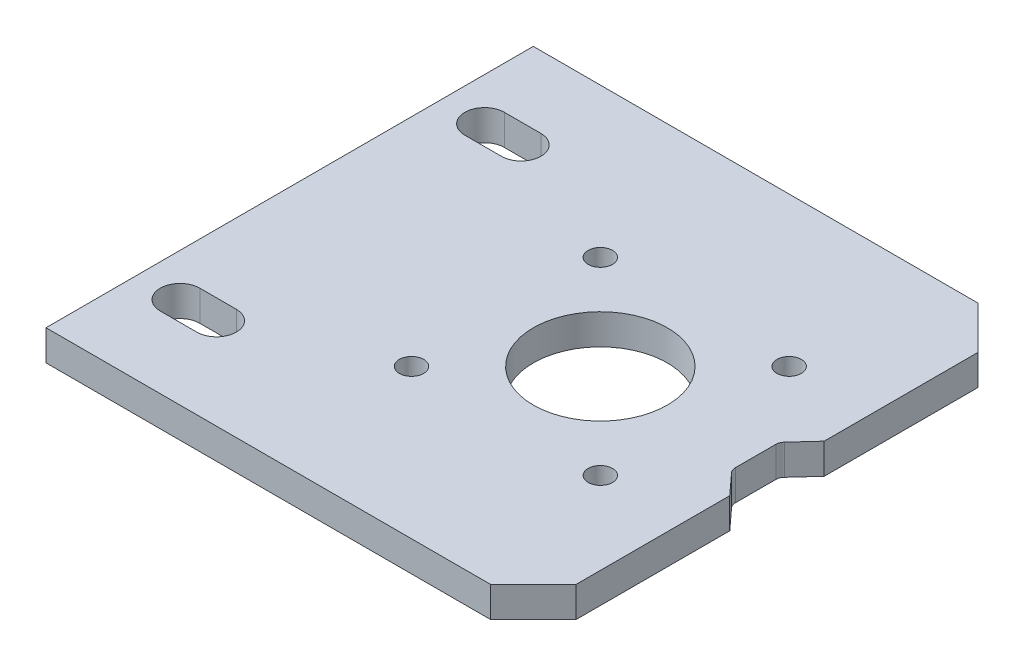
ISO-10303-21;
HEADER;
FILE_DESCRIPTION(('STEP AP214'),'2;1');
FILE_NAME('part.step','',(''),(''),'','','');
FILE_SCHEMA(('AUTOMOTIVE_DESIGN { 1 0 10303 214 1 1 1 1 }'));
ENDSEC;
DATA;
#1=APPLICATION_CONTEXT('core data for automotive mechanical design processes');
#2=APPLICATION_PROTOCOL_DEFINITION('international standard','automotive_design',2000,#1);
#3=PRODUCT_CONTEXT('',#1,'mechanical');
#4=PRODUCT('Part','Part','',(#3));
#5=PRODUCT_RELATED_PRODUCT_CATEGORY('part','',(#4));
#6=PRODUCT_DEFINITION_FORMATION('','',#4);
#7=PRODUCT_DEFINITION_CONTEXT('part definition',#1,'design');
#8=PRODUCT_DEFINITION('design','',#6,#7);
#9=PRODUCT_DEFINITION_SHAPE('','',#8);
#10=(LENGTH_UNIT() NAMED_UNIT(*) SI_UNIT(.MILLI.,.METRE.));
#11=(NAMED_UNIT(*) PLANE_ANGLE_UNIT() SI_UNIT($,.RADIAN.));
#12=(NAMED_UNIT(*) SI_UNIT($,.STERADIAN.) SOLID_ANGLE_UNIT());
#13=UNCERTAINTY_MEASURE_WITH_UNIT(LENGTH_MEASURE(1.E-05),#10,'distance_accuracy_value','');
#14=(GEOMETRIC_REPRESENTATION_CONTEXT(3) GLOBAL_UNCERTAINTY_ASSIGNED_CONTEXT((#13)) GLOBAL_UNIT_ASSIGNED_CONTEXT((#10,
#11,#12)) REPRESENTATION_CONTEXT('',''));
#15=CARTESIAN_POINT('',(0.,0.,0.));
#16=DIRECTION('',(0.,0.,1.));
#17=DIRECTION('',(1.,0.,0.));
#18=AXIS2_PLACEMENT_3D('',#15,#16,#17);
#19=CARTESIAN_POINT('',(77.9803084056823,0.,43.320819367824));
#20=DIRECTION('',(0.,-1.,0.));
#21=DIRECTION('',(0.,0.,-1.));
#22=AXIS2_PLACEMENT_3D('',#19,#20,#21);
#23=CYLINDRICAL_SURFACE('',#22,1.5);
#24=DIRECTION('',(0.,1.,0.));
#25=VECTOR('',#24,1.);
#26=CARTESIAN_POINT('',(76.8730916635267,0.,44.332783342425));
#27=LINE('',#26,#25);
#28=CARTESIAN_POINT('',(76.8730916635267,0.,44.332783342425));
#29=VERTEX_POINT('',#28);
#30=CARTESIAN_POINT('',(76.8730916635267,5.,44.332783342425));
#31=VERTEX_POINT('',#30);
#32=EDGE_CURVE('E417',#29,#31,#27,.T.);
#33=ORIENTED_EDGE('',*,*,#32,.F.);
#34=CARTESIAN_POINT('',(77.9803084056823,0.,43.320819367824));
#35=DIRECTION('',(0.,1.,0.));
#36=DIRECTION('',(0.,0.,1.));
#37=AXIS2_PLACEMENT_3D('',#34,#35,#36);
#38=CIRCLE('',#37,1.5);
#39=CARTESIAN_POINT('',(76.4803084056823,0.,43.320819367824));
#40=VERTEX_POINT('',#39);
#41=EDGE_CURVE('E49',#29,#40,#38,.F.);
#42=ORIENTED_EDGE('',*,*,#41,.T.);
#43=DIRECTION('',(0.,1.,0.));
#44=VECTOR('',#43,1.);
#45=CARTESIAN_POINT('',(76.4803084056823,0.,43.320819367824));
#46=LINE('',#45,#44);
#47=CARTESIAN_POINT('',(76.4803084056823,5.,43.320819367824));
#48=VERTEX_POINT('',#47);
#49=EDGE_CURVE('E421',#48,#40,#46,.F.);
#50=ORIENTED_EDGE('',*,*,#49,.F.);
#51=CARTESIAN_POINT('',(77.9803084056823,5.,43.320819367824));
#52=DIRECTION('',(0.,-1.,0.));
#53=DIRECTION('',(0.,0.,-1.));
#54=AXIS2_PLACEMENT_3D('',#51,#52,#53);
#55=CIRCLE('',#54,1.5);
#56=EDGE_CURVE('E12',#48,#31,#55,.F.);
#57=ORIENTED_EDGE('',*,*,#56,.T.);
#58=EDGE_LOOP('',(#33,#42,#50,#57));
#59=FACE_BOUND('',#58,.T.);
#60=ADVANCED_FACE('F41',(#59),#23,.F.);
#61=CARTESIAN_POINT('',(77.9803084056823,0.,36.679180632176));
#62=DIRECTION('',(0.,1.,0.));
#63=DIRECTION('',(0.,0.,1.));
#64=AXIS2_PLACEMENT_3D('',#61,#62,#63);
#65=CYLINDRICAL_SURFACE('',#64,1.5);
#66=DIRECTION('',(0.,-1.,0.));
#67=VECTOR('',#66,1.);
#68=CARTESIAN_POINT('',(76.8730916635267,0.,35.667216657575));
#69=LINE('',#68,#67);
#70=CARTESIAN_POINT('',(76.8730916635267,5.,35.667216657575));
#71=VERTEX_POINT('',#70);
#72=CARTESIAN_POINT('',(76.8730916635267,0.,35.667216657575));
#73=VERTEX_POINT('',#72);
#74=EDGE_CURVE('E184',#71,#73,#69,.T.);
#75=ORIENTED_EDGE('',*,*,#74,.F.);
#76=CARTESIAN_POINT('',(77.9803084056823,5.,36.679180632176));
#77=DIRECTION('',(0.,-1.,0.));
#78=DIRECTION('',(0.,0.,-1.));
#79=AXIS2_PLACEMENT_3D('',#76,#77,#78);
#80=CIRCLE('',#79,1.5);
#81=CARTESIAN_POINT('',(76.4803084056823,5.,36.679180632176));
#82=VERTEX_POINT('',#81);
#83=EDGE_CURVE('E411',#71,#82,#80,.F.);
#84=ORIENTED_EDGE('',*,*,#83,.T.);
#85=DIRECTION('',(0.,-1.,0.));
#86=VECTOR('',#85,1.);
#87=CARTESIAN_POINT('',(76.4803084056823,0.,36.679180632176));
#88=LINE('',#87,#86);
#89=CARTESIAN_POINT('',(76.4803084056823,0.,36.679180632176));
#90=VERTEX_POINT('',#89);
#91=EDGE_CURVE('E407',#90,#82,#88,.F.);
#92=ORIENTED_EDGE('',*,*,#91,.F.);
#93=CARTESIAN_POINT('',(77.9803084056823,0.,36.679180632176));
#94=DIRECTION('',(0.,1.,0.));
#95=DIRECTION('',(0.,0.,1.));
#96=AXIS2_PLACEMENT_3D('',#93,#94,#95);
#97=CIRCLE('',#96,1.5);
#98=EDGE_CURVE('E414',#90,#73,#97,.F.);
#99=ORIENTED_EDGE('',*,*,#98,.T.);
#100=EDGE_LOOP('',(#75,#84,#92,#99));
#101=FACE_BOUND('',#100,.T.);
#102=ADVANCED_FACE('F432',(#101),#65,.F.);
#103=CARTESIAN_POINT('',(80.,0.,80.));
#104=DIRECTION('',(-1.,0.,0.));
#105=DIRECTION('',(0.,0.,1.));
#106=AXIS2_PLACEMENT_3D('',#103,#104,#105);
#107=PLANE('',#106);
#108=DIRECTION('',(0.,0.,-1.));
#109=VECTOR('',#108,1.);
#110=CARTESIAN_POINT('',(80.,0.,80.));
#111=LINE('',#110,#109);
#112=CARTESIAN_POINT('',(80.,0.,73.));
#113=VERTEX_POINT('',#112);
#114=CARTESIAN_POINT('',(80.,0.,47.7540170505659));
#115=VERTEX_POINT('',#114);
#116=EDGE_CURVE('E209',#113,#115,#111,.T.);
#117=ORIENTED_EDGE('',*,*,#116,.T.);
#118=DIRECTION('',(0.,1.,0.));
#119=VECTOR('',#118,1.);
#120=CARTESIAN_POINT('',(80.,0.,47.7540170505659));
#121=LINE('',#120,#119);
#122=CARTESIAN_POINT('',(80.,5.,47.7540170505659));
#123=VERTEX_POINT('',#122);
#124=EDGE_CURVE('E199',#115,#123,#121,.T.);
#125=ORIENTED_EDGE('',*,*,#124,.T.);
#126=DIRECTION('',(0.,0.,-1.));
#127=VECTOR('',#126,1.);
#128=CARTESIAN_POINT('',(80.,5.,80.));
#129=LINE('',#128,#127);
#130=CARTESIAN_POINT('',(80.,5.,73.));
#131=VERTEX_POINT('',#130);
#132=EDGE_CURVE('E210',#131,#123,#129,.T.);
#133=ORIENTED_EDGE('',*,*,#132,.F.);
#134=DIRECTION('',(0.,-1.,0.));
#135=VECTOR('',#134,1.);
#136=CARTESIAN_POINT('',(80.,0.,73.));
#137=LINE('',#136,#135);
#138=EDGE_CURVE('E393',#131,#113,#137,.T.);
#139=ORIENTED_EDGE('',*,*,#138,.T.);
#140=EDGE_LOOP('',(#117,#125,#133,#139));
#141=FACE_BOUND('',#140,.T.);
#142=ADVANCED_FACE('F443',(#141),#107,.F.);
#143=CARTESIAN_POINT('',(0.,0.,80.));
#144=DIRECTION('',(1.,0.,0.));
#145=DIRECTION('',(0.,0.,-1.));
#146=AXIS2_PLACEMENT_3D('',#143,#144,#145);
#147=PLANE('',#146);
#148=DIRECTION('',(0.,-1.,0.));
#149=VECTOR('',#148,1.);
#150=CARTESIAN_POINT('',(0.,0.,0.));
#151=LINE('',#150,#149);
#152=CARTESIAN_POINT('',(0.,5.,0.));
#153=VERTEX_POINT('',#152);
#154=CARTESIAN_POINT('',(0.,0.,0.));
#155=VERTEX_POINT('',#154);
#156=EDGE_CURVE('E370',#153,#155,#151,.T.);
#157=ORIENTED_EDGE('',*,*,#156,.T.);
#158=DIRECTION('',(0.,0.,-1.));
#159=VECTOR('',#158,1.);
#160=CARTESIAN_POINT('',(0.,0.,80.));
#161=LINE('',#160,#159);
#162=CARTESIAN_POINT('',(0.,0.,80.));
#163=VERTEX_POINT('',#162);
#164=EDGE_CURVE('E215',#163,#155,#161,.T.);
#165=ORIENTED_EDGE('',*,*,#164,.F.);
#166=DIRECTION('',(0.,-1.,0.));
#167=VECTOR('',#166,1.);
#168=CARTESIAN_POINT('',(0.,0.,80.));
#169=LINE('',#168,#167);
#170=CARTESIAN_POINT('',(0.,5.,80.));
#171=VERTEX_POINT('',#170);
#172=EDGE_CURVE('E356',#171,#163,#169,.T.);
#173=ORIENTED_EDGE('',*,*,#172,.F.);
#174=DIRECTION('',(0.,0.,-1.));
#175=VECTOR('',#174,1.);
#176=CARTESIAN_POINT('',(0.,5.,80.));
#177=LINE('',#176,#175);
#178=EDGE_CURVE('E369',#171,#153,#177,.T.);
#179=ORIENTED_EDGE('',*,*,#178,.T.);
#180=EDGE_LOOP('',(#157,#165,#173,#179));
#181=FACE_BOUND('',#180,.T.);
#182=ADVANCED_FACE('F452',(#181),#147,.F.);
#183=CARTESIAN_POINT('',(0.,0.,80.));
#184=DIRECTION('',(0.,1.,0.));
#185=DIRECTION('',(0.,0.,1.));
#186=AXIS2_PLACEMENT_3D('',#183,#184,#185);
#187=PLANE('',#186);
#188=ORIENTED_EDGE('',*,*,#41,.F.);
#189=DIRECTION('',(0.674642649734014,0.,0.738144494770413));
#190=VECTOR('',#189,1.);
#191=CARTESIAN_POINT('',(80.,0.,47.7540170505659));
#192=LINE('',#191,#190);
#193=EDGE_CURVE('E200',#29,#115,#192,.T.);
#194=ORIENTED_EDGE('',*,*,#193,.T.);
#195=ORIENTED_EDGE('',*,*,#116,.F.);
#196=DIRECTION('',(0.707106781186546,0.,-0.707106781186549));
#197=VECTOR('',#196,1.);
#198=CARTESIAN_POINT('',(73.,0.,80.));
#199=LINE('',#198,#197);
#200=CARTESIAN_POINT('',(73.,0.,80.));
#201=VERTEX_POINT('',#200);
#202=EDGE_CURVE('E400',#113,#201,#199,.F.);
#203=ORIENTED_EDGE('',*,*,#202,.T.);
#204=DIRECTION('',(1.,0.,0.));
#205=VECTOR('',#204,1.);
#206=CARTESIAN_POINT('',(0.,0.,80.));
#207=LINE('',#206,#205);
#208=EDGE_CURVE('E361',#163,#201,#207,.T.);
#209=ORIENTED_EDGE('',*,*,#208,.F.);
#210=ORIENTED_EDGE('',*,*,#164,.T.);
#211=DIRECTION('',(1.,0.,0.));
#212=VECTOR('',#211,1.);
#213=CARTESIAN_POINT('',(0.,0.,0.));
#214=LINE('',#213,#212);
#215=CARTESIAN_POINT('',(73.,0.,0.));
#216=VERTEX_POINT('',#215);
#217=EDGE_CURVE('E374',#155,#216,#214,.T.);
#218=ORIENTED_EDGE('',*,*,#217,.T.);
#219=DIRECTION('',(0.707106781186548,0.,0.707106781186547));
#220=VECTOR('',#219,1.);
#221=CARTESIAN_POINT('',(80.,0.,7.00000000000002));
#222=LINE('',#221,#220);
#223=CARTESIAN_POINT('',(80.,0.,7.00000000000002));
#224=VERTEX_POINT('',#223);
#225=EDGE_CURVE('E206',#216,#224,#222,.T.);
#226=ORIENTED_EDGE('',*,*,#225,.T.);
#227=CARTESIAN_POINT('',(80.,0.,32.2459829494341));
#228=VERTEX_POINT('',#227);
#229=EDGE_CURVE('E195',#228,#224,#111,.T.);
#230=ORIENTED_EDGE('',*,*,#229,.F.);
#231=DIRECTION('',(-0.674642649734014,0.,0.738144494770413));
#232=VECTOR('',#231,1.);
#233=CARTESIAN_POINT('',(80.,0.,32.2459829494341));
#234=LINE('',#233,#232);
#235=EDGE_CURVE('E177',#228,#73,#234,.T.);
#236=ORIENTED_EDGE('',*,*,#235,.T.);
#237=ORIENTED_EDGE('',*,*,#98,.F.);
#238=DIRECTION('',(0.,0.,1.));
#239=VECTOR('',#238,1.);
#240=CARTESIAN_POINT('',(76.4803084056823,0.,36.0969712832722));
#241=LINE('',#240,#239);
#242=EDGE_CURVE('E188',#90,#40,#241,.T.);
#243=ORIENTED_EDGE('',*,*,#242,.T.);
#244=EDGE_LOOP('',(#188,#194,#195,#203,#209,#210,#218,#226,#230,#236,#237,#243));
#245=FACE_BOUND('',#244,.T.);
#246=DIRECTION('',(-1.,0.,0.));
#247=VECTOR('',#246,1.);
#248=CARTESIAN_POINT('',(7.00000000000002,0.,61.75));
#249=LINE('',#248,#247);
#250=CARTESIAN_POINT('',(13.,0.,61.75));
#251=VERTEX_POINT('',#250);
#252=CARTESIAN_POINT('',(7.00000000000002,0.,61.75));
#253=VERTEX_POINT('',#252);
#254=EDGE_CURVE('E282',#251,#253,#249,.T.);
#255=ORIENTED_EDGE('',*,*,#254,.T.);
#256=CARTESIAN_POINT('',(7.00000000000002,0.,65.));
#257=DIRECTION('',(0.,1.,0.));
#258=DIRECTION('',(0.,0.,-1.));
#259=AXIS2_PLACEMENT_3D('',#256,#257,#258);
#260=CIRCLE('',#259,3.25);
#261=CARTESIAN_POINT('',(7.00000000000002,0.,68.25));
#262=VERTEX_POINT('',#261);
#263=EDGE_CURVE('E269',#253,#262,#260,.T.);
#264=ORIENTED_EDGE('',*,*,#263,.T.);
#265=DIRECTION('',(1.,0.,0.));
#266=VECTOR('',#265,1.);
#267=CARTESIAN_POINT('',(7.00000000000002,0.,68.25));
#268=LINE('',#267,#266);
#269=CARTESIAN_POINT('',(13.,0.,68.25));
#270=VERTEX_POINT('',#269);
#271=EDGE_CURVE('E273',#262,#270,#268,.T.);
#272=ORIENTED_EDGE('',*,*,#271,.T.);
#273=CARTESIAN_POINT('',(13.,0.,65.));
#274=DIRECTION('',(0.,1.,0.));
#275=DIRECTION('',(0.,0.,-1.));
#276=AXIS2_PLACEMENT_3D('',#273,#274,#275);
#277=CIRCLE('',#276,3.25);
#278=EDGE_CURVE('E278',#270,#251,#277,.T.);
#279=ORIENTED_EDGE('',*,*,#278,.T.);
#280=EDGE_LOOP('',(#255,#264,#272,#279));
#281=FACE_BOUND('',#280,.T.);
#282=DIRECTION('',(-1.,0.,0.));
#283=VECTOR('',#282,1.);
#284=CARTESIAN_POINT('',(7.,0.,11.75));
#285=LINE('',#284,#283);
#286=CARTESIAN_POINT('',(13.,0.,11.75));
#287=VERTEX_POINT('',#286);
#288=CARTESIAN_POINT('',(7.,0.,11.75));
#289=VERTEX_POINT('',#288);
#290=EDGE_CURVE('E760',#287,#289,#285,.T.);
#291=ORIENTED_EDGE('',*,*,#290,.T.);
#292=CARTESIAN_POINT('',(7.,0.,15.));
#293=DIRECTION('',(0.,1.,0.));
#294=DIRECTION('',(0.,0.,1.));
#295=AXIS2_PLACEMENT_3D('',#292,#293,#294);
#296=CIRCLE('',#295,3.25);
#297=CARTESIAN_POINT('',(7.00000000000002,0.,18.25));
#298=VERTEX_POINT('',#297);
#299=EDGE_CURVE('E747',#289,#298,#296,.T.);
#300=ORIENTED_EDGE('',*,*,#299,.T.);
#301=DIRECTION('',(1.,0.,0.));
#302=VECTOR('',#301,1.);
#303=CARTESIAN_POINT('',(7.00000000000002,0.,18.25));
#304=LINE('',#303,#302);
#305=CARTESIAN_POINT('',(13.,0.,18.25));
#306=VERTEX_POINT('',#305);
#307=EDGE_CURVE('E751',#298,#306,#304,.T.);
#308=ORIENTED_EDGE('',*,*,#307,.T.);
#309=CARTESIAN_POINT('',(13.,0.,15.));
#310=DIRECTION('',(0.,1.,0.));
#311=DIRECTION('',(0.,0.,1.));
#312=AXIS2_PLACEMENT_3D('',#309,#310,#311);
#313=CIRCLE('',#312,3.25);
#314=EDGE_CURVE('E756',#306,#287,#313,.T.);
#315=ORIENTED_EDGE('',*,*,#314,.T.);
#316=EDGE_LOOP('',(#291,#300,#308,#315));
#317=FACE_BOUND('',#316,.T.);
#318=CARTESIAN_POINT('',(35.5,0.,55.5));
#319=DIRECTION('',(0.,1.,0.));
#320=DIRECTION('',(0.,0.,1.));
#321=AXIS2_PLACEMENT_3D('',#318,#319,#320);
#322=CIRCLE('',#321,2.);
#323=CARTESIAN_POINT('',(35.5,0.,57.5));
#324=VERTEX_POINT('',#323);
#325=EDGE_CURVE('E324',#324,#324,#322,.T.);
#326=ORIENTED_EDGE('',*,*,#325,.T.);
#327=EDGE_LOOP('',(#326));
#328=FACE_BOUND('',#327,.T.);
#329=CARTESIAN_POINT('',(66.5,0.,55.5));
#330=DIRECTION('',(0.,1.,0.));
#331=DIRECTION('',(0.,0.,1.));
#332=AXIS2_PLACEMENT_3D('',#329,#330,#331);
#333=CIRCLE('',#332,2.);
#334=CARTESIAN_POINT('',(66.5,0.,57.5));
#335=VERTEX_POINT('',#334);
#336=EDGE_CURVE('E327',#335,#335,#333,.T.);
#337=ORIENTED_EDGE('',*,*,#336,.T.);
#338=EDGE_LOOP('',(#337));
#339=FACE_BOUND('',#338,.T.);
#340=CARTESIAN_POINT('',(66.5,0.,24.5));
#341=DIRECTION('',(0.,1.,0.));
#342=DIRECTION('',(0.,0.,1.));
#343=AXIS2_PLACEMENT_3D('',#340,#341,#342);
#344=CIRCLE('',#343,2.);
#345=CARTESIAN_POINT('',(66.5,0.,26.5));
#346=VERTEX_POINT('',#345);
#347=EDGE_CURVE('E337',#346,#346,#344,.T.);
#348=ORIENTED_EDGE('',*,*,#347,.T.);
#349=EDGE_LOOP('',(#348));
#350=FACE_BOUND('',#349,.T.);
#351=CARTESIAN_POINT('',(35.5,0.,24.5));
#352=DIRECTION('',(0.,1.,0.));
#353=DIRECTION('',(0.,0.,1.));
#354=AXIS2_PLACEMENT_3D('',#351,#352,#353);
#355=CIRCLE('',#354,2.);
#356=CARTESIAN_POINT('',(35.5,0.,26.5));
#357=VERTEX_POINT('',#356);
#358=EDGE_CURVE('E346',#357,#357,#355,.T.);
#359=ORIENTED_EDGE('',*,*,#358,.T.);
#360=EDGE_LOOP('',(#359));
#361=FACE_BOUND('',#360,.T.);
#362=CARTESIAN_POINT('',(51.,0.,40.));
#363=DIRECTION('',(0.,1.,0.));
#364=DIRECTION('',(0.,0.,1.));
#365=AXIS2_PLACEMENT_3D('',#362,#363,#364);
#366=CIRCLE('',#365,11.);
#367=CARTESIAN_POINT('',(51.,0.,51.));
#368=VERTEX_POINT('',#367);
#369=EDGE_CURVE('E355',#368,#368,#366,.T.);
#370=ORIENTED_EDGE('',*,*,#369,.T.);
#371=EDGE_LOOP('',(#370));
#372=FACE_BOUND('',#371,.T.);
#373=ADVANCED_FACE('F202',(#245,#281,#317,#328,#339,#350,#361,#372),#187,.F.);
#374=CARTESIAN_POINT('',(80.,5.,32.2459829494341));
#375=VERTEX_POINT('',#374);
#376=CARTESIAN_POINT('',(80.,5.,7.00000000000002));
#377=VERTEX_POINT('',#376);
#378=EDGE_CURVE('E197',#375,#377,#129,.T.);
#379=ORIENTED_EDGE('',*,*,#378,.F.);
#380=DIRECTION('',(0.,1.,0.));
#381=VECTOR('',#380,1.);
#382=CARTESIAN_POINT('',(80.,0.,32.2459829494341));
#383=LINE('',#382,#381);
#384=EDGE_CURVE('E181',#228,#375,#383,.T.);
#385=ORIENTED_EDGE('',*,*,#384,.F.);
#386=ORIENTED_EDGE('',*,*,#229,.T.);
#387=DIRECTION('',(0.,1.,0.));
#388=VECTOR('',#387,1.);
#389=CARTESIAN_POINT('',(80.,5.,7.00000000000002));
#390=LINE('',#389,#388);
#391=EDGE_CURVE('E390',#224,#377,#390,.T.);
#392=ORIENTED_EDGE('',*,*,#391,.T.);
#393=EDGE_LOOP('',(#379,#385,#386,#392));
#394=FACE_BOUND('',#393,.T.);
#395=ADVANCED_FACE('F193',(#394),#107,.F.);
#396=CARTESIAN_POINT('',(0.,5.,80.));
#397=DIRECTION('',(0.,-1.,0.));
#398=DIRECTION('',(0.,0.,-1.));
#399=AXIS2_PLACEMENT_3D('',#396,#397,#398);
#400=PLANE('',#399);
#401=DIRECTION('',(1.,0.,0.));
#402=VECTOR('',#401,1.);
#403=CARTESIAN_POINT('',(7.00000000000002,5.,68.25));
#404=LINE('',#403,#402);
#405=CARTESIAN_POINT('',(7.00000000000002,5.,68.25));
#406=VERTEX_POINT('',#405);
#407=CARTESIAN_POINT('',(13.,5.,68.25));
#408=VERTEX_POINT('',#407);
#409=EDGE_CURVE('E290',#406,#408,#404,.T.);
#410=ORIENTED_EDGE('',*,*,#409,.F.);
#411=CARTESIAN_POINT('',(7.00000000000002,5.,65.));
#412=DIRECTION('',(0.,1.,0.));
#413=DIRECTION('',(0.,0.,-1.));
#414=AXIS2_PLACEMENT_3D('',#411,#412,#413);
#415=CIRCLE('',#414,3.25);
#416=CARTESIAN_POINT('',(7.00000000000002,5.,61.75));
#417=VERTEX_POINT('',#416);
#418=EDGE_CURVE('E267',#417,#406,#415,.T.);
#419=ORIENTED_EDGE('',*,*,#418,.F.);
#420=DIRECTION('',(-1.,0.,0.));
#421=VECTOR('',#420,1.);
#422=CARTESIAN_POINT('',(7.00000000000002,5.,61.75));
#423=LINE('',#422,#421);
#424=CARTESIAN_POINT('',(13.,5.,61.75));
#425=VERTEX_POINT('',#424);
#426=EDGE_CURVE('E274',#425,#417,#423,.T.);
#427=ORIENTED_EDGE('',*,*,#426,.F.);
#428=CARTESIAN_POINT('',(13.,5.,65.));
#429=DIRECTION('',(0.,1.,0.));
#430=DIRECTION('',(0.,0.,-1.));
#431=AXIS2_PLACEMENT_3D('',#428,#429,#430);
#432=CIRCLE('',#431,3.25);
#433=EDGE_CURVE('E306',#408,#425,#432,.T.);
#434=ORIENTED_EDGE('',*,*,#433,.F.);
#435=EDGE_LOOP('',(#410,#419,#427,#434));
#436=FACE_BOUND('',#435,.T.);
#437=DIRECTION('',(1.,0.,0.));
#438=VECTOR('',#437,1.);
#439=CARTESIAN_POINT('',(7.00000000000002,5.,18.25));
#440=LINE('',#439,#438);
#441=CARTESIAN_POINT('',(7.00000000000002,5.,18.25));
#442=VERTEX_POINT('',#441);
#443=CARTESIAN_POINT('',(13.,5.,18.25));
#444=VERTEX_POINT('',#443);
#445=EDGE_CURVE('E500',#442,#444,#440,.T.);
#446=ORIENTED_EDGE('',*,*,#445,.F.);
#447=CARTESIAN_POINT('',(7.,5.,15.));
#448=DIRECTION('',(0.,1.,0.));
#449=DIRECTION('',(0.,0.,1.));
#450=AXIS2_PLACEMENT_3D('',#447,#448,#449);
#451=CIRCLE('',#450,3.25);
#452=CARTESIAN_POINT('',(7.,5.,11.75));
#453=VERTEX_POINT('',#452);
#454=EDGE_CURVE('E765',#453,#442,#451,.T.);
#455=ORIENTED_EDGE('',*,*,#454,.F.);
#456=DIRECTION('',(-1.,0.,0.));
#457=VECTOR('',#456,1.);
#458=CARTESIAN_POINT('',(7.,5.,11.75));
#459=LINE('',#458,#457);
#460=CARTESIAN_POINT('',(13.,5.,11.75));
#461=VERTEX_POINT('',#460);
#462=EDGE_CURVE('E752',#461,#453,#459,.T.);
#463=ORIENTED_EDGE('',*,*,#462,.F.);
#464=CARTESIAN_POINT('',(13.,5.,15.));
#465=DIRECTION('',(0.,1.,0.));
#466=DIRECTION('',(0.,0.,1.));
#467=AXIS2_PLACEMENT_3D('',#464,#465,#466);
#468=CIRCLE('',#467,3.25);
#469=EDGE_CURVE('E778',#444,#461,#468,.T.);
#470=ORIENTED_EDGE('',*,*,#469,.F.);
#471=EDGE_LOOP('',(#446,#455,#463,#470));
#472=FACE_BOUND('',#471,.T.);
#473=CARTESIAN_POINT('',(35.5,5.,55.5));
#474=DIRECTION('',(0.,1.,0.));
#475=DIRECTION('',(0.,0.,1.));
#476=AXIS2_PLACEMENT_3D('',#473,#474,#475);
#477=CIRCLE('',#476,2.);
#478=CARTESIAN_POINT('',(35.5,5.,57.5));
#479=VERTEX_POINT('',#478);
#480=EDGE_CURVE('E318',#479,#479,#477,.T.);
#481=ORIENTED_EDGE('',*,*,#480,.F.);
#482=EDGE_LOOP('',(#481));
#483=FACE_BOUND('',#482,.T.);
#484=CARTESIAN_POINT('',(66.5,5.,55.5));
#485=DIRECTION('',(0.,1.,0.));
#486=DIRECTION('',(0.,0.,1.));
#487=AXIS2_PLACEMENT_3D('',#484,#485,#486);
#488=CIRCLE('',#487,2.);
#489=CARTESIAN_POINT('',(66.5,5.,57.5));
#490=VERTEX_POINT('',#489);
#491=EDGE_CURVE('E332',#490,#490,#488,.T.);
#492=ORIENTED_EDGE('',*,*,#491,.F.);
#493=EDGE_LOOP('',(#492));
#494=FACE_BOUND('',#493,.T.);
#495=CARTESIAN_POINT('',(66.5,5.,24.5));
#496=DIRECTION('',(0.,1.,0.));
#497=DIRECTION('',(0.,0.,1.));
#498=AXIS2_PLACEMENT_3D('',#495,#496,#497);
#499=CIRCLE('',#498,2.);
#500=CARTESIAN_POINT('',(66.5,5.,26.5));
#501=VERTEX_POINT('',#500);
#502=EDGE_CURVE('E331',#501,#501,#499,.T.);
#503=ORIENTED_EDGE('',*,*,#502,.F.);
#504=EDGE_LOOP('',(#503));
#505=FACE_BOUND('',#504,.T.);
#506=CARTESIAN_POINT('',(35.5,5.,24.5));
#507=DIRECTION('',(0.,1.,0.));
#508=DIRECTION('',(0.,0.,1.));
#509=AXIS2_PLACEMENT_3D('',#506,#507,#508);
#510=CIRCLE('',#509,2.);
#511=CARTESIAN_POINT('',(35.5,5.,26.5));
#512=VERTEX_POINT('',#511);
#513=EDGE_CURVE('E510',#512,#512,#510,.T.);
#514=ORIENTED_EDGE('',*,*,#513,.F.);
#515=EDGE_LOOP('',(#514));
#516=FACE_BOUND('',#515,.T.);
#517=CARTESIAN_POINT('',(51.,5.,40.));
#518=DIRECTION('',(0.,1.,0.));
#519=DIRECTION('',(0.,0.,1.));
#520=AXIS2_PLACEMENT_3D('',#517,#518,#519);
#521=CIRCLE('',#520,11.);
#522=CARTESIAN_POINT('',(51.,5.,51.));
#523=VERTEX_POINT('',#522);
#524=EDGE_CURVE('E349',#523,#523,#521,.T.);
#525=ORIENTED_EDGE('',*,*,#524,.F.);
#526=EDGE_LOOP('',(#525));
#527=FACE_BOUND('',#526,.T.);
#528=ORIENTED_EDGE('',*,*,#132,.T.);
#529=DIRECTION('',(0.674642649734014,0.,0.738144494770413));
#530=VECTOR('',#529,1.);
#531=CARTESIAN_POINT('',(80.,5.,47.7540170505659));
#532=LINE('',#531,#530);
#533=EDGE_CURVE('E189',#31,#123,#532,.T.);
#534=ORIENTED_EDGE('',*,*,#533,.F.);
#535=ORIENTED_EDGE('',*,*,#56,.F.);
#536=DIRECTION('',(0.,0.,1.));
#537=VECTOR('',#536,1.);
#538=CARTESIAN_POINT('',(76.4803084056823,5.,36.0969712832722));
#539=LINE('',#538,#537);
#540=EDGE_CURVE('E251',#82,#48,#539,.T.);
#541=ORIENTED_EDGE('',*,*,#540,.F.);
#542=ORIENTED_EDGE('',*,*,#83,.F.);
#543=DIRECTION('',(-0.674642649734014,0.,0.738144494770413));
#544=VECTOR('',#543,1.);
#545=CARTESIAN_POINT('',(80.,5.,32.2459829494341));
#546=LINE('',#545,#544);
#547=EDGE_CURVE('E247',#375,#71,#546,.T.);
#548=ORIENTED_EDGE('',*,*,#547,.F.);
#549=ORIENTED_EDGE('',*,*,#378,.T.);
#550=DIRECTION('',(-0.707106781186548,0.,-0.707106781186547));
#551=VECTOR('',#550,1.);
#552=CARTESIAN_POINT('',(80.,5.,7.00000000000002));
#553=LINE('',#552,#551);
#554=CARTESIAN_POINT('',(73.,5.,0.));
#555=VERTEX_POINT('',#554);
#556=EDGE_CURVE('E228',#377,#555,#553,.T.);
#557=ORIENTED_EDGE('',*,*,#556,.T.);
#558=DIRECTION('',(-1.,0.,0.));
#559=VECTOR('',#558,1.);
#560=CARTESIAN_POINT('',(0.,5.,0.));
#561=LINE('',#560,#559);
#562=EDGE_CURVE('E362',#555,#153,#561,.T.);
#563=ORIENTED_EDGE('',*,*,#562,.T.);
#564=ORIENTED_EDGE('',*,*,#178,.F.);
#565=DIRECTION('',(-1.,0.,0.));
#566=VECTOR('',#565,1.);
#567=CARTESIAN_POINT('',(0.,5.,80.));
#568=LINE('',#567,#566);
#569=CARTESIAN_POINT('',(73.,5.,80.));
#570=VERTEX_POINT('',#569);
#571=EDGE_CURVE('E366',#570,#171,#568,.T.);
#572=ORIENTED_EDGE('',*,*,#571,.F.);
#573=DIRECTION('',(-0.707106781186546,0.,0.707106781186549));
#574=VECTOR('',#573,1.);
#575=CARTESIAN_POINT('',(73.,5.,80.));
#576=LINE('',#575,#574);
#577=EDGE_CURVE('E232',#570,#131,#576,.F.);
#578=ORIENTED_EDGE('',*,*,#577,.T.);
#579=EDGE_LOOP('',(#528,#534,#535,#541,#542,#548,#549,#557,#563,#564,#572,#578));
#580=FACE_BOUND('',#579,.T.);
#581=ADVANCED_FACE('F385',(#436,#472,#483,#494,#505,#516,#527,#580),#400,.F.);
#582=CARTESIAN_POINT('',(0.,0.,80.));
#583=DIRECTION('',(0.,0.,-1.));
#584=DIRECTION('',(-1.,0.,0.));
#585=AXIS2_PLACEMENT_3D('',#582,#583,#584);
#586=PLANE('',#585);
#587=ORIENTED_EDGE('',*,*,#208,.T.);
#588=DIRECTION('',(0.,1.,0.));
#589=VECTOR('',#588,1.);
#590=CARTESIAN_POINT('',(73.,0.,80.));
#591=LINE('',#590,#589);
#592=EDGE_CURVE('E224',#201,#570,#591,.T.);
#593=ORIENTED_EDGE('',*,*,#592,.T.);
#594=ORIENTED_EDGE('',*,*,#571,.T.);
#595=ORIENTED_EDGE('',*,*,#172,.T.);
#596=EDGE_LOOP('',(#587,#593,#594,#595));
#597=FACE_BOUND('',#596,.T.);
#598=ADVANCED_FACE('F449',(#597),#586,.F.);
#599=CARTESIAN_POINT('',(0.,0.,0.));
#600=DIRECTION('',(0.,0.,-1.));
#601=DIRECTION('',(-1.,0.,0.));
#602=AXIS2_PLACEMENT_3D('',#599,#600,#601);
#603=PLANE('',#602);
#604=ORIENTED_EDGE('',*,*,#562,.F.);
#605=DIRECTION('',(0.,-1.,0.));
#606=VECTOR('',#605,1.);
#607=CARTESIAN_POINT('',(73.,0.,0.));
#608=LINE('',#607,#606);
#609=EDGE_CURVE('E391',#555,#216,#608,.T.);
#610=ORIENTED_EDGE('',*,*,#609,.T.);
#611=ORIENTED_EDGE('',*,*,#217,.F.);
#612=ORIENTED_EDGE('',*,*,#156,.F.);
#613=EDGE_LOOP('',(#604,#610,#611,#612));
#614=FACE_BOUND('',#613,.T.);
#615=ADVANCED_FACE('F454',(#614),#603,.T.);
#616=CARTESIAN_POINT('',(51.,0.,40.));
#617=DIRECTION('',(0.,1.,0.));
#618=DIRECTION('',(0.,0.,1.));
#619=AXIS2_PLACEMENT_3D('',#616,#617,#618);
#620=CYLINDRICAL_SURFACE('',#619,11.);
#621=ORIENTED_EDGE('',*,*,#369,.F.);
#622=EDGE_LOOP('',(#621));
#623=FACE_BOUND('',#622,.T.);
#624=ORIENTED_EDGE('',*,*,#524,.T.);
#625=EDGE_LOOP('',(#624));
#626=FACE_BOUND('',#625,.T.);
#627=ADVANCED_FACE('F456',(#623,#626),#620,.F.);
#628=CARTESIAN_POINT('',(35.5,0.,24.5));
#629=DIRECTION('',(0.,1.,0.));
#630=DIRECTION('',(0.,0.,1.));
#631=AXIS2_PLACEMENT_3D('',#628,#629,#630);
#632=CYLINDRICAL_SURFACE('',#631,2.);
#633=ORIENTED_EDGE('',*,*,#358,.F.);
#634=EDGE_LOOP('',(#633));
#635=FACE_BOUND('',#634,.T.);
#636=ORIENTED_EDGE('',*,*,#513,.T.);
#637=EDGE_LOOP('',(#636));
#638=FACE_BOUND('',#637,.T.);
#639=ADVANCED_FACE('F462',(#635,#638),#632,.F.);
#640=CARTESIAN_POINT('',(66.5,0.,24.5));
#641=DIRECTION('',(0.,1.,0.));
#642=DIRECTION('',(0.,0.,1.));
#643=AXIS2_PLACEMENT_3D('',#640,#641,#642);
#644=CYLINDRICAL_SURFACE('',#643,2.);
#645=ORIENTED_EDGE('',*,*,#347,.F.);
#646=EDGE_LOOP('',(#645));
#647=FACE_BOUND('',#646,.T.);
#648=ORIENTED_EDGE('',*,*,#502,.T.);
#649=EDGE_LOOP('',(#648));
#650=FACE_BOUND('',#649,.T.);
#651=ADVANCED_FACE('F525',(#647,#650),#644,.F.);
#652=CARTESIAN_POINT('',(66.5,0.,55.5));
#653=DIRECTION('',(0.,1.,0.));
#654=DIRECTION('',(0.,0.,1.));
#655=AXIS2_PLACEMENT_3D('',#652,#653,#654);
#656=CYLINDRICAL_SURFACE('',#655,2.);
#657=ORIENTED_EDGE('',*,*,#336,.F.);
#658=EDGE_LOOP('',(#657));
#659=FACE_BOUND('',#658,.T.);
#660=ORIENTED_EDGE('',*,*,#491,.T.);
#661=EDGE_LOOP('',(#660));
#662=FACE_BOUND('',#661,.T.);
#663=ADVANCED_FACE('F528',(#659,#662),#656,.F.);
#664=CARTESIAN_POINT('',(35.5,0.,55.5));
#665=DIRECTION('',(0.,1.,0.));
#666=DIRECTION('',(0.,0.,1.));
#667=AXIS2_PLACEMENT_3D('',#664,#665,#666);
#668=CYLINDRICAL_SURFACE('',#667,2.);
#669=ORIENTED_EDGE('',*,*,#325,.F.);
#670=EDGE_LOOP('',(#669));
#671=FACE_BOUND('',#670,.T.);
#672=ORIENTED_EDGE('',*,*,#480,.T.);
#673=EDGE_LOOP('',(#672));
#674=FACE_BOUND('',#673,.T.);
#675=ADVANCED_FACE('F481',(#671,#674),#668,.F.);
#676=CARTESIAN_POINT('',(73.,0.,80.));
#677=DIRECTION('',(-0.707106781186549,0.,-0.707106781186546));
#678=DIRECTION('',(0.,1.,0.));
#679=AXIS2_PLACEMENT_3D('',#676,#677,#678);
#680=PLANE('',#679);
#681=ORIENTED_EDGE('',*,*,#202,.F.);
#682=ORIENTED_EDGE('',*,*,#138,.F.);
#683=ORIENTED_EDGE('',*,*,#577,.F.);
#684=ORIENTED_EDGE('',*,*,#592,.F.);
#685=EDGE_LOOP('',(#681,#682,#683,#684));
#686=FACE_BOUND('',#685,.T.);
#687=ADVANCED_FACE('F446',(#686),#680,.F.);
#688=CARTESIAN_POINT('',(80.,0.,7.00000000000002));
#689=DIRECTION('',(0.707106781186547,0.,-0.707106781186548));
#690=DIRECTION('',(0.,-1.,0.));
#691=AXIS2_PLACEMENT_3D('',#688,#689,#690);
#692=PLANE('',#691);
#693=ORIENTED_EDGE('',*,*,#225,.F.);
#694=ORIENTED_EDGE('',*,*,#609,.F.);
#695=ORIENTED_EDGE('',*,*,#556,.F.);
#696=ORIENTED_EDGE('',*,*,#391,.F.);
#697=EDGE_LOOP('',(#693,#694,#695,#696));
#698=FACE_BOUND('',#697,.T.);
#699=ADVANCED_FACE('F389',(#698),#692,.T.);
#700=CARTESIAN_POINT('',(7.,0.,15.));
#701=DIRECTION('',(0.,1.,0.));
#702=DIRECTION('',(0.,0.,1.));
#703=AXIS2_PLACEMENT_3D('',#700,#701,#702);
#704=CYLINDRICAL_SURFACE('',#703,3.25);
#705=ORIENTED_EDGE('',*,*,#454,.T.);
#706=DIRECTION('',(0.,1.,0.));
#707=VECTOR('',#706,1.);
#708=CARTESIAN_POINT('',(7.00000000000002,0.,18.25));
#709=LINE('',#708,#707);
#710=EDGE_CURVE('E764',#298,#442,#709,.T.);
#711=ORIENTED_EDGE('',*,*,#710,.F.);
#712=ORIENTED_EDGE('',*,*,#299,.F.);
#713=DIRECTION('',(0.,1.,0.));
#714=VECTOR('',#713,1.);
#715=CARTESIAN_POINT('',(7.,0.,11.75));
#716=LINE('',#715,#714);
#717=EDGE_CURVE('E325',#289,#453,#716,.T.);
#718=ORIENTED_EDGE('',*,*,#717,.T.);
#719=EDGE_LOOP('',(#705,#711,#712,#718));
#720=FACE_BOUND('',#719,.T.);
#721=ADVANCED_FACE('F478',(#720),#704,.F.);
#722=CARTESIAN_POINT('',(7.,0.,11.75));
#723=DIRECTION('',(0.,0.,-1.));
#724=DIRECTION('',(-1.,0.,0.));
#725=AXIS2_PLACEMENT_3D('',#722,#723,#724);
#726=PLANE('',#725);
#727=ORIENTED_EDGE('',*,*,#462,.T.);
#728=ORIENTED_EDGE('',*,*,#717,.F.);
#729=ORIENTED_EDGE('',*,*,#290,.F.);
#730=DIRECTION('',(0.,1.,0.));
#731=VECTOR('',#730,1.);
#732=CARTESIAN_POINT('',(13.,0.,11.75));
#733=LINE('',#732,#731);
#734=EDGE_CURVE('E791',#287,#461,#733,.T.);
#735=ORIENTED_EDGE('',*,*,#734,.T.);
#736=EDGE_LOOP('',(#727,#728,#729,#735));
#737=FACE_BOUND('',#736,.T.);
#738=ADVANCED_FACE('F544',(#737),#726,.F.);
#739=CARTESIAN_POINT('',(13.,0.,15.));
#740=DIRECTION('',(0.,1.,0.));
#741=DIRECTION('',(0.,0.,1.));
#742=AXIS2_PLACEMENT_3D('',#739,#740,#741);
#743=CYLINDRICAL_SURFACE('',#742,3.25);
#744=ORIENTED_EDGE('',*,*,#469,.T.);
#745=ORIENTED_EDGE('',*,*,#734,.F.);
#746=ORIENTED_EDGE('',*,*,#314,.F.);
#747=DIRECTION('',(0.,1.,0.));
#748=VECTOR('',#747,1.);
#749=CARTESIAN_POINT('',(13.,0.,18.25));
#750=LINE('',#749,#748);
#751=EDGE_CURVE('E794',#306,#444,#750,.T.);
#752=ORIENTED_EDGE('',*,*,#751,.T.);
#753=EDGE_LOOP('',(#744,#745,#746,#752));
#754=FACE_BOUND('',#753,.T.);
#755=ADVANCED_FACE('F550',(#754),#743,.F.);
#756=CARTESIAN_POINT('',(7.00000000000002,0.,18.25));
#757=DIRECTION('',(0.,0.,1.));
#758=DIRECTION('',(1.,0.,0.));
#759=AXIS2_PLACEMENT_3D('',#756,#757,#758);
#760=PLANE('',#759);
#761=ORIENTED_EDGE('',*,*,#445,.T.);
#762=ORIENTED_EDGE('',*,*,#751,.F.);
#763=ORIENTED_EDGE('',*,*,#307,.F.);
#764=ORIENTED_EDGE('',*,*,#710,.T.);
#765=EDGE_LOOP('',(#761,#762,#763,#764));
#766=FACE_BOUND('',#765,.T.);
#767=ADVANCED_FACE('F546',(#766),#760,.F.);
#768=CARTESIAN_POINT('',(7.00000000000002,0.,65.));
#769=DIRECTION('',(0.,1.,0.));
#770=DIRECTION('',(0.,0.,1.));
#771=AXIS2_PLACEMENT_3D('',#768,#769,#770);
#772=CYLINDRICAL_SURFACE('',#771,3.25);
#773=ORIENTED_EDGE('',*,*,#418,.T.);
#774=DIRECTION('',(0.,1.,0.));
#775=VECTOR('',#774,1.);
#776=CARTESIAN_POINT('',(7.00000000000002,0.,68.25));
#777=LINE('',#776,#775);
#778=EDGE_CURVE('E286',#262,#406,#777,.T.);
#779=ORIENTED_EDGE('',*,*,#778,.F.);
#780=ORIENTED_EDGE('',*,*,#263,.F.);
#781=DIRECTION('',(0.,1.,0.));
#782=VECTOR('',#781,1.);
#783=CARTESIAN_POINT('',(7.00000000000002,0.,61.75));
#784=LINE('',#783,#782);
#785=EDGE_CURVE('E733',#253,#417,#784,.T.);
#786=ORIENTED_EDGE('',*,*,#785,.T.);
#787=EDGE_LOOP('',(#773,#779,#780,#786));
#788=FACE_BOUND('',#787,.T.);
#789=ADVANCED_FACE('F549',(#788),#772,.F.);
#790=CARTESIAN_POINT('',(7.00000000000002,0.,61.75));
#791=DIRECTION('',(0.,0.,-1.));
#792=DIRECTION('',(-1.,0.,0.));
#793=AXIS2_PLACEMENT_3D('',#790,#791,#792);
#794=PLANE('',#793);
#795=ORIENTED_EDGE('',*,*,#426,.T.);
#796=ORIENTED_EDGE('',*,*,#785,.F.);
#797=ORIENTED_EDGE('',*,*,#254,.F.);
#798=DIRECTION('',(0.,1.,0.));
#799=VECTOR('',#798,1.);
#800=CARTESIAN_POINT('',(13.,0.,61.75));
#801=LINE('',#800,#799);
#802=EDGE_CURVE('E735',#251,#425,#801,.T.);
#803=ORIENTED_EDGE('',*,*,#802,.T.);
#804=EDGE_LOOP('',(#795,#796,#797,#803));
#805=FACE_BOUND('',#804,.T.);
#806=ADVANCED_FACE('F560',(#805),#794,.F.);
#807=CARTESIAN_POINT('',(13.,0.,65.));
#808=DIRECTION('',(0.,1.,0.));
#809=DIRECTION('',(0.,0.,1.));
#810=AXIS2_PLACEMENT_3D('',#807,#808,#809);
#811=CYLINDRICAL_SURFACE('',#810,3.25);
#812=ORIENTED_EDGE('',*,*,#433,.T.);
#813=ORIENTED_EDGE('',*,*,#802,.F.);
#814=ORIENTED_EDGE('',*,*,#278,.F.);
#815=DIRECTION('',(0.,1.,0.));
#816=VECTOR('',#815,1.);
#817=CARTESIAN_POINT('',(13.,0.,68.25));
#818=LINE('',#817,#816);
#819=EDGE_CURVE('E741',#270,#408,#818,.T.);
#820=ORIENTED_EDGE('',*,*,#819,.T.);
#821=EDGE_LOOP('',(#812,#813,#814,#820));
#822=FACE_BOUND('',#821,.T.);
#823=ADVANCED_FACE('F565',(#822),#811,.F.);
#824=CARTESIAN_POINT('',(7.00000000000002,0.,68.25));
#825=DIRECTION('',(0.,0.,1.));
#826=DIRECTION('',(1.,0.,0.));
#827=AXIS2_PLACEMENT_3D('',#824,#825,#826);
#828=PLANE('',#827);
#829=ORIENTED_EDGE('',*,*,#409,.T.);
#830=ORIENTED_EDGE('',*,*,#819,.F.);
#831=ORIENTED_EDGE('',*,*,#271,.F.);
#832=ORIENTED_EDGE('',*,*,#778,.T.);
#833=EDGE_LOOP('',(#829,#830,#831,#832));
#834=FACE_BOUND('',#833,.T.);
#835=ADVANCED_FACE('F562',(#834),#828,.F.);
#836=CARTESIAN_POINT('',(80.,0.,47.7540170505659));
#837=DIRECTION('',(-0.738144494770414,0.,0.674642649734014));
#838=DIRECTION('',(0.674642649734014,0.,0.738144494770414));
#839=AXIS2_PLACEMENT_3D('',#836,#837,#838);
#840=PLANE('',#839);
#841=ORIENTED_EDGE('',*,*,#193,.F.);
#842=ORIENTED_EDGE('',*,*,#32,.T.);
#843=ORIENTED_EDGE('',*,*,#533,.T.);
#844=ORIENTED_EDGE('',*,*,#124,.F.);
#845=EDGE_LOOP('',(#841,#842,#843,#844));
#846=FACE_BOUND('',#845,.T.);
#847=ADVANCED_FACE('F440',(#846),#840,.F.);
#848=CARTESIAN_POINT('',(76.4803084056823,0.,36.0969712832722));
#849=DIRECTION('',(-1.,0.,0.));
#850=DIRECTION('',(0.,0.,1.));
#851=AXIS2_PLACEMENT_3D('',#848,#849,#850);
#852=PLANE('',#851);
#853=ORIENTED_EDGE('',*,*,#540,.T.);
#854=ORIENTED_EDGE('',*,*,#49,.T.);
#855=ORIENTED_EDGE('',*,*,#242,.F.);
#856=ORIENTED_EDGE('',*,*,#91,.T.);
#857=EDGE_LOOP('',(#853,#854,#855,#856));
#858=FACE_BOUND('',#857,.T.);
#859=ADVANCED_FACE('F427',(#858),#852,.F.);
#860=CARTESIAN_POINT('',(80.,0.,32.2459829494341));
#861=DIRECTION('',(-0.738144494770414,0.,-0.674642649734014));
#862=DIRECTION('',(-0.674642649734014,0.,0.738144494770414));
#863=AXIS2_PLACEMENT_3D('',#860,#861,#862);
#864=PLANE('',#863);
#865=ORIENTED_EDGE('',*,*,#547,.T.);
#866=ORIENTED_EDGE('',*,*,#74,.T.);
#867=ORIENTED_EDGE('',*,*,#235,.F.);
#868=ORIENTED_EDGE('',*,*,#384,.T.);
#869=EDGE_LOOP('',(#865,#866,#867,#868));
#870=FACE_BOUND('',#869,.T.);
#871=ADVANCED_FACE('F180',(#870),#864,.F.);
#872=CLOSED_SHELL('',(#60,#102,#142,#182,#373,#395,#581,#598,#615,#627,#639,#651,#663,#675,#687,
#699,#721,#738,#755,#767,#789,#806,#823,#835,#847,#859,#871));
#873=MANIFOLD_SOLID_BREP('B2',#872);
#874=ADVANCED_BREP_SHAPE_REPRESENTATION('',(#18,#873),#14);
#875=SHAPE_DEFINITION_REPRESENTATION(#9,#874);
ENDSEC;
END-ISO-10303-21;
